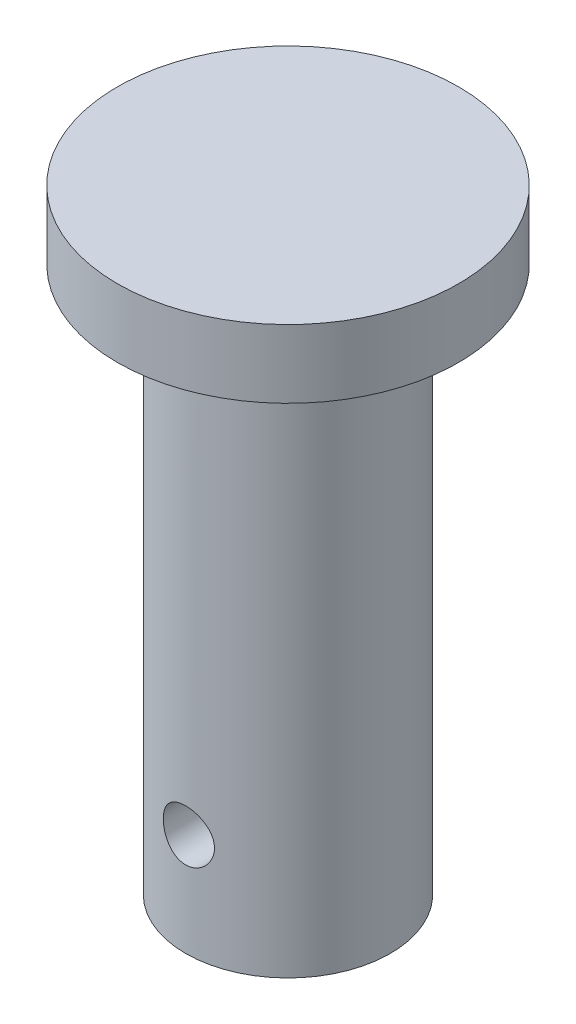
ISO-10303-21;
HEADER;
FILE_DESCRIPTION(('STEP AP214'),'2;1');
FILE_NAME('part.step','',(''),(''),'','','');
FILE_SCHEMA(('AUTOMOTIVE_DESIGN { 1 0 10303 214 1 1 1 1 }'));
ENDSEC;
DATA;
#1=APPLICATION_CONTEXT('core data for automotive mechanical design processes');
#2=APPLICATION_PROTOCOL_DEFINITION('international standard','automotive_design',2000,#1);
#3=PRODUCT_CONTEXT('',#1,'mechanical');
#4=PRODUCT('Part','Part','',(#3));
#5=PRODUCT_RELATED_PRODUCT_CATEGORY('part','',(#4));
#6=PRODUCT_DEFINITION_FORMATION('','',#4);
#7=PRODUCT_DEFINITION_CONTEXT('part definition',#1,'design');
#8=PRODUCT_DEFINITION('design','',#6,#7);
#9=PRODUCT_DEFINITION_SHAPE('','',#8);
#10=(LENGTH_UNIT() NAMED_UNIT(*) SI_UNIT(.MILLI.,.METRE.));
#11=(NAMED_UNIT(*) PLANE_ANGLE_UNIT() SI_UNIT($,.RADIAN.));
#12=(NAMED_UNIT(*) SI_UNIT($,.STERADIAN.) SOLID_ANGLE_UNIT());
#13=UNCERTAINTY_MEASURE_WITH_UNIT(LENGTH_MEASURE(1.E-05),#10,'distance_accuracy_value','');
#14=(GEOMETRIC_REPRESENTATION_CONTEXT(3) GLOBAL_UNCERTAINTY_ASSIGNED_CONTEXT((#13)) GLOBAL_UNIT_ASSIGNED_CONTEXT((#10,
#11,#12)) REPRESENTATION_CONTEXT('',''));
#15=CARTESIAN_POINT('',(0.,0.,0.));
#16=DIRECTION('',(0.,0.,1.));
#17=DIRECTION('',(1.,0.,0.));
#18=AXIS2_PLACEMENT_3D('',#15,#16,#17);
#19=CARTESIAN_POINT('',(0.,0.,0.));
#20=DIRECTION('',(0.,1.,0.));
#21=DIRECTION('',(0.,0.,1.));
#22=AXIS2_PLACEMENT_3D('',#19,#20,#21);
#23=PLANE('',#22);
#24=CARTESIAN_POINT('',(0.,0.,0.));
#25=DIRECTION('',(0.,1.,0.));
#26=DIRECTION('',(0.,0.,1.));
#27=AXIS2_PLACEMENT_3D('',#24,#25,#26);
#28=CIRCLE('',#27,6.);
#29=CARTESIAN_POINT('',(0.,0.,6.));
#30=VERTEX_POINT('',#29);
#31=EDGE_CURVE('E10',#30,#30,#28,.T.);
#32=ORIENTED_EDGE('',*,*,#31,.F.);
#33=EDGE_LOOP('',(#32));
#34=FACE_BOUND('',#33,.T.);
#35=ADVANCED_FACE('F33',(#34),#23,.F.);
#36=CARTESIAN_POINT('',(0.,36.,0.));
#37=DIRECTION('',(0.,1.,0.));
#38=DIRECTION('',(0.,0.,1.));
#39=AXIS2_PLACEMENT_3D('',#36,#37,#38);
#40=CYLINDRICAL_SURFACE('',#39,6.);
#41=CARTESIAN_POINT('',(0.,4.5,6.));
#42=CARTESIAN_POINT('',(-0.0828760886697311,4.50000232573816,5.99999859868013));
#43=CARTESIAN_POINT('',(-0.165778157830763,4.50689155077379,5.99826578131828));
#44=CARTESIAN_POINT('',(-0.329206323770533,4.53422515130701,5.99152113829892));
#45=CARTESIAN_POINT('',(-0.409731046870739,4.55467720953785,5.98650745419968));
#46=CARTESIAN_POINT('',(-0.566020872182577,4.60843925346209,5.9737562633204));
#47=CARTESIAN_POINT('',(-0.641791563430003,4.64173379871528,5.96602202842087));
#48=CARTESIAN_POINT('',(-0.786672131904427,4.72018139004484,5.94865343807593));
#49=CARTESIAN_POINT('',(-0.855781784348759,4.76533483611894,5.9390190185405));
#50=CARTESIAN_POINT('',(-0.98680192730092,4.86720078965421,5.91867413591801));
#51=CARTESIAN_POINT('',(-1.04855569006107,4.92411157495918,5.90794707148533));
#52=CARTESIAN_POINT('',(-1.1617489272033,5.04745220490892,5.88673620117529));
#53=CARTESIAN_POINT('',(-1.21318723694913,5.1138831229465,5.87625242288348));
#54=CARTESIAN_POINT('',(-1.30502654279903,5.25559522673744,5.8565477569971));
#55=CARTESIAN_POINT('',(-1.34525221592536,5.33099323081041,5.84734794470605));
#56=CARTESIAN_POINT('',(-1.41239690855053,5.48774841165836,5.83149494812223));
#57=CARTESIAN_POINT('',(-1.43931805543933,5.56910463332576,5.82484135672789));
#58=CARTESIAN_POINT('',(-1.47855483680429,5.73374349820248,5.81500476717551));
#59=CARTESIAN_POINT('',(-1.49115226833334,5.8169548960498,5.81175491075426));
#60=CARTESIAN_POINT('',(-1.50226177506785,5.98436856901398,5.80889362537741));
#61=CARTESIAN_POINT('',(-1.50077614181798,6.06857068069861,5.80928160448644));
#62=CARTESIAN_POINT('',(-1.48398652463928,6.23341580774448,5.81359205496618));
#63=CARTESIAN_POINT('',(-1.46901834019052,6.3140956214651,5.81742863001879));
#64=CARTESIAN_POINT('',(-1.42622418690311,6.47176105091129,5.82806709676484));
#65=CARTESIAN_POINT('',(-1.39839730206942,6.54874640302899,5.83486919970696));
#66=CARTESIAN_POINT('',(-1.33038947793715,6.69773801625207,5.85075113904186));
#67=CARTESIAN_POINT('',(-1.29008666723291,6.76968617178956,5.85985327469421));
#68=CARTESIAN_POINT('',(-1.19835627601495,6.90591870975684,5.87929710846386));
#69=CARTESIAN_POINT('',(-1.14692674880884,6.97020174806726,5.88963902334735));
#70=CARTESIAN_POINT('',(-1.03266342468122,7.0912036156944,5.91075880539781));
#71=CARTESIAN_POINT('',(-0.96954625816586,7.14765449006135,5.92154069477971));
#72=CARTESIAN_POINT('',(-0.8346119175037,7.24922124246391,5.94205965578786));
#73=CARTESIAN_POINT('',(-0.762794477707944,7.29433677426357,5.95179669549415));
#74=CARTESIAN_POINT('',(-0.612115888681392,7.37205058622439,5.96917732094183));
#75=CARTESIAN_POINT('',(-0.533231393208624,7.40460534025443,5.97681360127725));
#76=CARTESIAN_POINT('',(-0.370876008142883,7.45591730570958,5.98907916991419));
#77=CARTESIAN_POINT('',(-0.287405999150485,7.47467715641814,5.99370903339281));
#78=CARTESIAN_POINT('',(-0.120539970390027,7.49745756555884,5.99935499271375));
#79=CARTESIAN_POINT('',(-0.0371967199882104,7.5018430260753,6.00046053508279));
#80=CARTESIAN_POINT('',(0.129032874801507,7.49675099794452,5.99918804814451));
#81=CARTESIAN_POINT('',(0.211919259644594,7.48727475720087,5.99681033241846));
#82=CARTESIAN_POINT('',(0.373614268776491,7.45502909160862,5.98889581127357));
#83=CARTESIAN_POINT('',(0.452465118968754,7.43245873652301,5.98340634185811));
#84=CARTESIAN_POINT('',(0.60525729245251,7.37489291597155,5.96988706634134));
#85=CARTESIAN_POINT('',(0.679198119032634,7.33989619568683,5.96185700369892));
#86=CARTESIAN_POINT('',(0.821523134429846,7.25776387112527,5.9439330792631));
#87=CARTESIAN_POINT('',(0.889785441835829,7.21042388760324,5.93400867366932));
#88=CARTESIAN_POINT('',(1.01752661364325,7.10521009120303,5.91344509187419));
#89=CARTESIAN_POINT('',(1.07700395897301,7.0473344603831,5.90280579251705));
#90=CARTESIAN_POINT('',(1.18699056807273,6.92099803915554,5.88168956960771));
#91=CARTESIAN_POINT('',(1.23724386762203,6.85231229699758,5.87122304187281));
#92=CARTESIAN_POINT('',(1.3255107590127,6.70726736553429,5.85192878377239));
#93=CARTESIAN_POINT('',(1.36352489415794,6.63090851704025,5.84310098067026));
#94=CARTESIAN_POINT('',(1.42595142060929,6.47309427758692,5.82818094734665));
#95=CARTESIAN_POINT('',(1.45044439665406,6.39167237165599,5.82207255291906));
#96=CARTESIAN_POINT('',(1.48534565995378,6.2256903621109,5.81326744090183));
#97=CARTESIAN_POINT('',(1.49575702747866,6.14113094896751,5.81056997719936));
#98=CARTESIAN_POINT('',(1.50203859033399,5.9738789761448,5.80894901203957));
#99=CARTESIAN_POINT('',(1.49831789778012,5.89120256487527,5.80991932728264));
#100=CARTESIAN_POINT('',(1.47737727831287,5.72769611133202,5.81527909007843));
#101=CARTESIAN_POINT('',(1.46015762268677,5.64686603198635,5.81966846891857));
#102=CARTESIAN_POINT('',(1.41293131944279,5.4897915409346,5.83131260682722));
#103=CARTESIAN_POINT('',(1.38300140468038,5.41352269475979,5.83855015236309));
#104=CARTESIAN_POINT('',(1.31126491360507,5.26703461728631,5.85507755724829));
#105=CARTESIAN_POINT('',(1.26945669003419,5.19681622681309,5.86436770120773));
#106=CARTESIAN_POINT('',(1.17386774863714,5.06244537099798,5.88425634263512));
#107=CARTESIAN_POINT('',(1.11980316291226,4.99849892657604,5.89488264831757));
#108=CARTESIAN_POINT('',(1.00178937118974,4.88045295520459,5.91608027246286));
#109=CARTESIAN_POINT('',(0.937837821261147,4.82635576988703,5.9266515772706));
#110=CARTESIAN_POINT('',(0.800467586702591,4.72858869143539,5.94677655647663));
#111=CARTESIAN_POINT('',(0.726898422316387,4.68512538632842,5.95630833365868));
#112=CARTESIAN_POINT('',(0.573266059510477,4.61125253705947,5.97304924975118));
#113=CARTESIAN_POINT('',(0.49320756343674,4.58083363935147,5.98026005199781));
#114=CARTESIAN_POINT('',(0.344410253243473,4.53842816967035,5.99048059565542));
#115=CARTESIAN_POINT('',(0.27638017090807,4.52404875694657,5.99402585052691));
#116=CARTESIAN_POINT('',(0.138906071536284,4.50483405637806,5.99878605231948));
#117=CARTESIAN_POINT('',(0.0694621612426168,4.4999980506947,6.00000117450894));
#118=CARTESIAN_POINT('',(0.,4.5,6.));
#119=B_SPLINE_CURVE_WITH_KNOTS('',3,(#41,#42,#43,#44,#45,#46,#47,#48,#49,#50,#51,#52,#53,#54,
#55,#56,#57,#58,#59,#60,#61,#62,#63,#64,#65,#66,#67,#68,#69,#70,#71,#72,#73,#74,#75,#76,#77,#78,
#79,#80,#81,#82,#83,#84,#85,#86,#87,#88,#89,#90,#91,#92,#93,#94,#95,#96,#97,#98,#99,#100,#101,
#102,#103,#104,#105,#106,#107,#108,#109,#110,#111,#112,#113,#114,#115,#116,#117,#118),
.UNSPECIFIED.,.T.,.F.,(4,2,2,2,2,2,2,2,2,2,2,2,2,2,2,2,2,2,2,2,2,2,2,2,2,2,2,2,2,2,2,2,2,2,2,2,
2,2,4),(0.,0.24837371247189,0.4968882377639,0.745104902286106,0.993329940169328,
1.24614435437139,1.49898729580062,1.75558647545807,2.01214461169368,2.2635629509943,
2.51494038112697,2.76022497007018,3.00552703466038,3.25330527873879,3.50112690836163,
3.75601500969019,4.01091089558247,4.26668229009114,4.52240473688643,4.77158308949276,
5.02073901112743,5.26620274514037,5.5116912732229,5.76153587565352,6.01142363008019,
6.26744509204476,6.52345518749508,6.77792254614036,7.03233423252408,7.27943780398612,
7.52653640956034,7.77216400559447,8.01782568136901,8.2698957640991,8.52202569770417,
8.77872185499588,9.0352336382135,9.24342242942149,9.45159556043039),.UNSPECIFIED.);
#120=CARTESIAN_POINT('',(0.,4.5,6.));
#121=VERTEX_POINT('',#120);
#122=EDGE_CURVE('E36',#121,#121,#119,.T.);
#123=ORIENTED_EDGE('',*,*,#122,.T.);
#124=EDGE_LOOP('',(#123));
#125=FACE_BOUND('',#124,.T.);
#126=CARTESIAN_POINT('',(1.5,6.,-5.80947501931113));
#127=CARTESIAN_POINT('',(1.49999764715507,6.08283045055477,-5.80947660051185));
#128=CARTESIAN_POINT('',(1.49311574729838,6.1656869392068,-5.81126583608348));
#129=CARTESIAN_POINT('',(1.46581387527848,6.32902054690442,-5.81821117195949));
#130=CARTESIAN_POINT('',(1.44538602404532,6.409496252681,-5.82336923173088));
#131=CARTESIAN_POINT('',(1.39169471977917,6.56568212291223,-5.8364323475758));
#132=CARTESIAN_POINT('',(1.35844783671268,6.6413982932314,-5.84433385614245));
#133=CARTESIAN_POINT('',(1.28011268475685,6.78618651152395,-5.86198915217285));
#134=CARTESIAN_POINT('',(1.23502391313642,6.85525827724814,-5.87174301827101));
#135=CARTESIAN_POINT('',(1.13322505638712,6.98631698715733,-5.89224429813367));
#136=CARTESIAN_POINT('',(1.07630213262243,7.04813616021003,-5.90300758573818));
#137=CARTESIAN_POINT('',(0.952909238460398,7.16145683661621,-5.92417725309178));
#138=CARTESIAN_POINT('',(0.886438376508184,7.21295737537305,-5.93458359939834));
#139=CARTESIAN_POINT('',(0.744687120647372,7.30486528057877,-5.95404249312349));
#140=CARTESIAN_POINT('',(0.669296745717071,7.34510783289688,-5.96307412440355));
#141=CARTESIAN_POINT('',(0.512557910575657,7.41228578649185,-5.9785848715559));
#142=CARTESIAN_POINT('',(0.431210331475164,7.43922315114931,-5.98506436400607));
#143=CARTESIAN_POINT('',(0.266615255252496,7.47848870074715,-5.99462855308908));
#144=CARTESIAN_POINT('',(0.183439631729385,7.49110178659595,-5.99777936306589));
#145=CARTESIAN_POINT('',(0.016097291557661,7.50225502756533,-6.00056156464379));
#146=CARTESIAN_POINT('',(-0.0680692767228416,7.50079726332576,-6.00019347658022));
#147=CARTESIAN_POINT('',(-0.233028370758581,7.48405508984992,-5.99602856972121));
#148=CARTESIAN_POINT('',(-0.313854323401601,7.46907820496769,-5.99230801404524));
#149=CARTESIAN_POINT('',(-0.47180737112053,7.4262172379709,-5.98194501914912));
#150=CARTESIAN_POINT('',(-0.548934269055657,7.39833246877356,-5.97530242439065));
#151=CARTESIAN_POINT('',(-0.69811005525271,7.33019845758776,-5.95972505820537));
#152=CARTESIAN_POINT('',(-0.770106764649757,7.28983977320295,-5.95077011817032));
#153=CARTESIAN_POINT('',(-0.906413433510734,7.19798659253025,-5.9315394228579));
#154=CARTESIAN_POINT('',(-0.970722052628258,7.14649015886363,-5.92126343791494));
#155=CARTESIAN_POINT('',(-1.09166105262743,7.03217475481058,-5.90018228261712));
#156=CARTESIAN_POINT('',(-1.1480365186128,6.96908706459134,-5.88937031715551));
#157=CARTESIAN_POINT('',(-1.24946456394453,6.83424001587585,-5.86869026110024));
#158=CARTESIAN_POINT('',(-1.29451661406902,6.7624802523054,-5.85882221463582));
#159=CARTESIAN_POINT('',(-1.3721821935339,6.61182597951062,-5.84112298098989));
#160=CARTESIAN_POINT('',(-1.40473435045574,6.53289856181209,-5.83330190235432));
#161=CARTESIAN_POINT('',(-1.45602843095451,6.37044871915413,-5.82071184083974));
#162=CARTESIAN_POINT('',(-1.47477330982936,6.28692728161012,-5.81594220486131));
#163=CARTESIAN_POINT('',(-1.49749778319911,6.12002429908613,-5.81013213623485));
#164=CARTESIAN_POINT('',(-1.50185428435178,6.03669732400222,-5.80899653456189));
#165=CARTESIAN_POINT('',(-1.49671019430933,5.87050683805311,-5.81032406088624));
#166=CARTESIAN_POINT('',(-1.48721087870928,5.78764328522926,-5.8127868576076));
#167=CARTESIAN_POINT('',(-1.4549552783626,5.62613144102718,-5.82094249172736));
#168=CARTESIAN_POINT('',(-1.43241844096905,5.5474363640575,-5.82658182140625));
#169=CARTESIAN_POINT('',(-1.37497084900237,5.39494112528899,-5.84040430962577));
#170=CARTESIAN_POINT('',(-1.34005862862753,5.3211415445668,-5.84858776949168));
#171=CARTESIAN_POINT('',(-1.25806240076193,5.17893523327959,-5.86677682255957));
#172=CARTESIAN_POINT('',(-1.21075305230138,5.11066269597414,-5.87681501163985));
#173=CARTESIAN_POINT('',(-1.10559043940168,4.98288698231919,-5.8975024984303));
#174=CARTESIAN_POINT('',(-1.04773544220816,4.92338525000996,-5.90815189637082));
#175=CARTESIAN_POINT('',(-0.921394081477088,4.81331337445743,-5.92918441818964));
#176=CARTESIAN_POINT('',(-0.852677928797389,4.76300396247071,-5.93955421237101));
#177=CARTESIAN_POINT('',(-0.707554024042012,4.67463847982926,-5.95858329968241));
#178=CARTESIAN_POINT('',(-0.631146673436385,4.63658177003508,-5.96724268202376));
#179=CARTESIAN_POINT('',(-0.473337302596634,4.57413237928324,-5.98182069442988));
#180=CARTESIAN_POINT('',(-0.391976071541821,4.54964142937256,-5.98775898013446));
#181=CARTESIAN_POINT('',(-0.226124640478211,4.51472379923495,-5.99631176037473));
#182=CARTESIAN_POINT('',(-0.141635047561864,4.50429440475657,-5.99892689636045));
#183=CARTESIAN_POINT('',(0.0256252896649908,4.4979486156367,-6.00051254113217));
#184=CARTESIAN_POINT('',(0.108380740449051,4.50164743635692,-5.99957968320012));
#185=CARTESIAN_POINT('',(0.27205124462211,4.5225717409415,-5.99438844686135));
#186=CARTESIAN_POINT('',(0.352966352671331,4.53979682251965,-5.99013016735643));
#187=CARTESIAN_POINT('',(0.510256553467225,4.58707832965639,-5.97878149280944));
#188=CARTESIAN_POINT('',(0.586653741871529,4.61706517997194,-5.97170646753999));
#189=CARTESIAN_POINT('',(0.733375579562203,4.68895586852899,-5.95546933370076));
#190=CARTESIAN_POINT('',(0.803699461897578,4.73086120900435,-5.94630696206604));
#191=CARTESIAN_POINT('',(0.93810289263585,4.82657285099561,-5.92660874521999));
#192=CARTESIAN_POINT('',(1.00199248245088,4.88064021436107,-5.91604525418417));
#193=CARTESIAN_POINT('',(1.11992253040688,4.9986342779607,-5.89485973579863));
#194=CARTESIAN_POINT('',(1.17396048760228,5.06256347414686,-5.88423769428834));
#195=CARTESIAN_POINT('',(1.27164303971884,5.199902121302,-5.86391213790822));
#196=CARTESIAN_POINT('',(1.31507492916982,5.27346618511894,-5.85422945594827));
#197=CARTESIAN_POINT('',(1.3888903449235,5.42708323488405,-5.83715933325923));
#198=CARTESIAN_POINT('',(1.41928336463958,5.50713144916012,-5.82977022370054));
#199=CARTESIAN_POINT('',(1.46163379284816,5.65586551774008,-5.81927863109675));
#200=CARTESIAN_POINT('',(1.47598975589307,5.72383974657579,-5.8156299450082));
#201=CARTESIAN_POINT('',(1.4951734388599,5.86120330349995,-5.81072757878358));
#202=CARTESIAN_POINT('',(1.50000197155828,5.93059251036759,-5.80947369434945));
#203=CARTESIAN_POINT('',(1.5,6.,-5.80947501931113));
#204=B_SPLINE_CURVE_WITH_KNOTS('',3,(#126,#127,#128,#129,#130,#131,#132,#133,#134,#135,#136,
#137,#138,#139,#140,#141,#142,#143,#144,#145,#146,#147,#148,#149,#150,#151,#152,#153,#154,#155,
#156,#157,#158,#159,#160,#161,#162,#163,#164,#165,#166,#167,#168,#169,#170,#171,#172,#173,#174,
#175,#176,#177,#178,#179,#180,#181,#182,#183,#184,#185,#186,#187,#188,#189,#190,#191,#192,#193,
#194,#195,#196,#197,#198,#199,#200,#201,#202,#203),.UNSPECIFIED.,.T.,.F.,(4,2,2,2,2,2,2,2,2,2,2,
2,2,2,2,2,2,2,2,2,2,2,2,2,2,2,2,2,2,2,2,2,2,2,2,2,2,2,4),(0.,0.248236465041681,0.4966174448572,
0.744678436299613,0.992749960532871,1.24574372515786,1.4987611288792,1.75530897838752,
2.01181895908255,2.26313250597208,2.51440889199612,2.76010957613368,3.00582334034872,
3.25375724552667,3.50173431281348,3.75642279943147,4.01112318719881,4.26705859205041,
4.52293920077728,4.7720614485703,5.02116076310281,5.26618443005524,5.51123712852851,
5.76109707515494,6.01099811331027,6.26715198579191,6.52329249431732,6.77755243684158,
7.03176329345423,7.27910067676474,7.52643070426189,7.77242925935826,8.01845883442843,
8.27038257949243,8.52237018939305,8.77905886370806,9.03556032819972,9.24358696306398,
9.45159585059712),.UNSPECIFIED.);
#205=CARTESIAN_POINT('',(1.5,6.,-5.80947501931113));
#206=VERTEX_POINT('',#205);
#207=EDGE_CURVE('E52',#206,#206,#204,.T.);
#208=ORIENTED_EDGE('',*,*,#207,.T.);
#209=EDGE_LOOP('',(#208));
#210=FACE_BOUND('',#209,.T.);
#211=CARTESIAN_POINT('',(0.,32.,0.));
#212=DIRECTION('',(0.,1.,0.));
#213=DIRECTION('',(0.,0.,1.));
#214=AXIS2_PLACEMENT_3D('',#211,#212,#213);
#215=CIRCLE('',#214,6.);
#216=CARTESIAN_POINT('',(0.,32.,6.));
#217=VERTEX_POINT('',#216);
#218=EDGE_CURVE('E44',#217,#217,#215,.T.);
#219=ORIENTED_EDGE('',*,*,#218,.F.);
#220=EDGE_LOOP('',(#219));
#221=FACE_BOUND('',#220,.T.);
#222=ORIENTED_EDGE('',*,*,#31,.T.);
#223=EDGE_LOOP('',(#222));
#224=FACE_BOUND('',#223,.T.);
#225=ADVANCED_FACE('F57',(#125,#210,#221,#224),#40,.T.);
#226=CARTESIAN_POINT('',(6.,32.,0.));
#227=DIRECTION('',(0.,1.,0.));
#228=DIRECTION('',(0.,0.,1.));
#229=AXIS2_PLACEMENT_3D('',#226,#227,#228);
#230=PLANE('',#229);
#231=CARTESIAN_POINT('',(0.,32.,0.));
#232=DIRECTION('',(0.,1.,0.));
#233=DIRECTION('',(0.,0.,1.));
#234=AXIS2_PLACEMENT_3D('',#231,#232,#233);
#235=CIRCLE('',#234,10.);
#236=CARTESIAN_POINT('',(0.,32.,10.));
#237=VERTEX_POINT('',#236);
#238=EDGE_CURVE('E49',#237,#237,#235,.T.);
#239=ORIENTED_EDGE('',*,*,#238,.F.);
#240=EDGE_LOOP('',(#239));
#241=FACE_BOUND('',#240,.T.);
#242=ORIENTED_EDGE('',*,*,#218,.T.);
#243=EDGE_LOOP('',(#242));
#244=FACE_BOUND('',#243,.T.);
#245=ADVANCED_FACE('F72',(#241,#244),#230,.F.);
#246=CARTESIAN_POINT('',(0.,36.,0.));
#247=DIRECTION('',(0.,1.,0.));
#248=DIRECTION('',(0.,0.,1.));
#249=AXIS2_PLACEMENT_3D('',#246,#247,#248);
#250=CYLINDRICAL_SURFACE('',#249,10.);
#251=CARTESIAN_POINT('',(0.,36.,0.));
#252=DIRECTION('',(0.,1.,0.));
#253=DIRECTION('',(0.,0.,1.));
#254=AXIS2_PLACEMENT_3D('',#251,#252,#253);
#255=CIRCLE('',#254,10.);
#256=CARTESIAN_POINT('',(0.,36.,10.));
#257=VERTEX_POINT('',#256);
#258=EDGE_CURVE('E122',#257,#257,#255,.T.);
#259=ORIENTED_EDGE('',*,*,#258,.F.);
#260=EDGE_LOOP('',(#259));
#261=FACE_BOUND('',#260,.T.);
#262=ORIENTED_EDGE('',*,*,#238,.T.);
#263=EDGE_LOOP('',(#262));
#264=FACE_BOUND('',#263,.T.);
#265=ADVANCED_FACE('F69',(#261,#264),#250,.T.);
#266=CARTESIAN_POINT('',(10.,36.,0.));
#267=DIRECTION('',(0.,-1.,0.));
#268=DIRECTION('',(0.,0.,-1.));
#269=AXIS2_PLACEMENT_3D('',#266,#267,#268);
#270=PLANE('',#269);
#271=ORIENTED_EDGE('',*,*,#258,.T.);
#272=EDGE_LOOP('',(#271));
#273=FACE_BOUND('',#272,.T.);
#274=ADVANCED_FACE('F64',(#273),#270,.F.);
#275=CARTESIAN_POINT('',(0.,6.,-7.));
#276=DIRECTION('',(0.,0.,1.));
#277=DIRECTION('',(1.,0.,0.));
#278=AXIS2_PLACEMENT_3D('',#275,#276,#277);
#279=CYLINDRICAL_SURFACE('',#278,1.5);
#280=ORIENTED_EDGE('',*,*,#207,.F.);
#281=EDGE_LOOP('',(#280));
#282=FACE_BOUND('',#281,.T.);
#283=ORIENTED_EDGE('',*,*,#122,.F.);
#284=EDGE_LOOP('',(#283));
#285=FACE_BOUND('',#284,.T.);
#286=ADVANCED_FACE('F60',(#282,#285),#279,.F.);
#287=CLOSED_SHELL('',(#35,#225,#245,#265,#274,#286));
#288=MANIFOLD_SOLID_BREP('B2',#287);
#289=ADVANCED_BREP_SHAPE_REPRESENTATION('',(#18,#288),#14);
#290=SHAPE_DEFINITION_REPRESENTATION(#9,#289);
ENDSEC;
END-ISO-10303-21;
